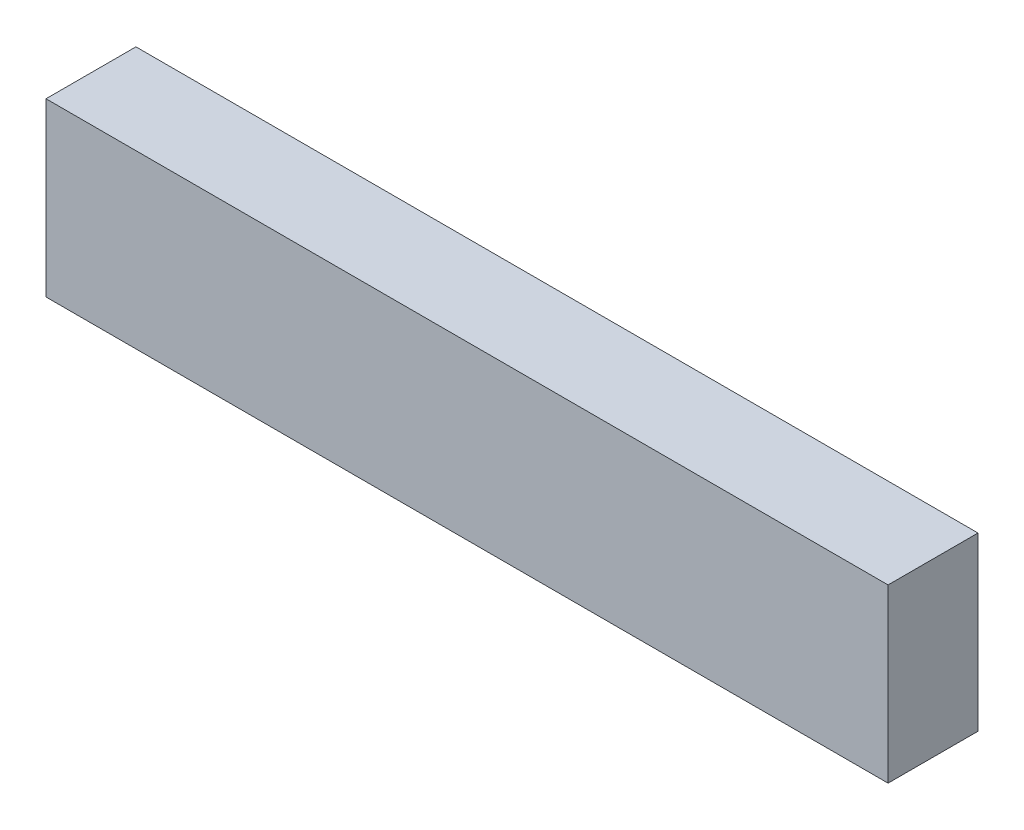
ISO-10303-21;
HEADER;
FILE_DESCRIPTION(('STEP AP214'),'2;1');
FILE_NAME('part.step','',(''),(''),'','','');
FILE_SCHEMA(('AUTOMOTIVE_DESIGN { 1 0 10303 214 1 1 1 1 }'));
ENDSEC;
DATA;
#1=APPLICATION_CONTEXT('core data for automotive mechanical design processes');
#2=APPLICATION_PROTOCOL_DEFINITION('international standard','automotive_design',2000,#1);
#3=PRODUCT_CONTEXT('',#1,'mechanical');
#4=PRODUCT('Part','Part','',(#3));
#5=PRODUCT_RELATED_PRODUCT_CATEGORY('part','',(#4));
#6=PRODUCT_DEFINITION_FORMATION('','',#4);
#7=PRODUCT_DEFINITION_CONTEXT('part definition',#1,'design');
#8=PRODUCT_DEFINITION('design','',#6,#7);
#9=PRODUCT_DEFINITION_SHAPE('','',#8);
#10=(LENGTH_UNIT() NAMED_UNIT(*) SI_UNIT(.MILLI.,.METRE.));
#11=(NAMED_UNIT(*) PLANE_ANGLE_UNIT() SI_UNIT($,.RADIAN.));
#12=(NAMED_UNIT(*) SI_UNIT($,.STERADIAN.) SOLID_ANGLE_UNIT());
#13=UNCERTAINTY_MEASURE_WITH_UNIT(LENGTH_MEASURE(1.E-05),#10,'distance_accuracy_value','');
#14=(GEOMETRIC_REPRESENTATION_CONTEXT(3) GLOBAL_UNCERTAINTY_ASSIGNED_CONTEXT((#13)) GLOBAL_UNIT_ASSIGNED_CONTEXT((#10,
#11,#12)) REPRESENTATION_CONTEXT('',''));
#15=CARTESIAN_POINT('',(0.,0.,0.));
#16=DIRECTION('',(0.,0.,1.));
#17=DIRECTION('',(1.,0.,0.));
#18=AXIS2_PLACEMENT_3D('',#15,#16,#17);
#19=CARTESIAN_POINT('',(0.,66.675,0.));
#20=DIRECTION('',(1.,0.,0.));
#21=DIRECTION('',(0.,0.,-1.));
#22=AXIS2_PLACEMENT_3D('',#19,#20,#21);
#23=PLANE('',#22);
#24=DIRECTION('',(0.,0.,1.));
#25=VECTOR('',#24,1.);
#26=CARTESIAN_POINT('',(0.,0.,0.));
#27=LINE('',#26,#25);
#28=CARTESIAN_POINT('',(0.,0.,-34.925));
#29=VERTEX_POINT('',#28);
#30=CARTESIAN_POINT('',(0.,0.,0.));
#31=VERTEX_POINT('',#30);
#32=EDGE_CURVE('E112',#29,#31,#27,.T.);
#33=ORIENTED_EDGE('',*,*,#32,.T.);
#34=DIRECTION('',(0.,-1.,0.));
#35=VECTOR('',#34,1.);
#36=CARTESIAN_POINT('',(0.,66.675,0.));
#37=LINE('',#36,#35);
#38=CARTESIAN_POINT('',(0.,66.675,0.));
#39=VERTEX_POINT('',#38);
#40=EDGE_CURVE('E11',#39,#31,#37,.T.);
#41=ORIENTED_EDGE('',*,*,#40,.F.);
#42=DIRECTION('',(0.,0.,1.));
#43=VECTOR('',#42,1.);
#44=CARTESIAN_POINT('',(0.,66.675,0.));
#45=LINE('',#44,#43);
#46=CARTESIAN_POINT('',(0.,66.675,-34.925));
#47=VERTEX_POINT('',#46);
#48=EDGE_CURVE('E96',#47,#39,#45,.T.);
#49=ORIENTED_EDGE('',*,*,#48,.F.);
#50=DIRECTION('',(0.,-1.,0.));
#51=VECTOR('',#50,1.);
#52=CARTESIAN_POINT('',(0.,66.675,-34.925));
#53=LINE('',#52,#51);
#54=EDGE_CURVE('E108',#47,#29,#53,.T.);
#55=ORIENTED_EDGE('',*,*,#54,.T.);
#56=EDGE_LOOP('',(#33,#41,#49,#55));
#57=FACE_BOUND('',#56,.T.);
#58=ADVANCED_FACE('F44',(#57),#23,.F.);
#59=CARTESIAN_POINT('',(0.,66.675,0.));
#60=DIRECTION('',(0.,0.,-1.));
#61=DIRECTION('',(-1.,0.,0.));
#62=AXIS2_PLACEMENT_3D('',#59,#60,#61);
#63=PLANE('',#62);
#64=DIRECTION('',(1.,0.,0.));
#65=VECTOR('',#64,1.);
#66=CARTESIAN_POINT('',(0.,0.,0.));
#67=LINE('',#66,#65);
#68=CARTESIAN_POINT('',(327.025,0.,0.));
#69=VERTEX_POINT('',#68);
#70=EDGE_CURVE('E101',#31,#69,#67,.T.);
#71=ORIENTED_EDGE('',*,*,#70,.T.);
#72=DIRECTION('',(0.,-1.,0.));
#73=VECTOR('',#72,1.);
#74=CARTESIAN_POINT('',(327.025,66.675,0.));
#75=LINE('',#74,#73);
#76=CARTESIAN_POINT('',(327.025,66.675,0.));
#77=VERTEX_POINT('',#76);
#78=EDGE_CURVE('E53',#77,#69,#75,.T.);
#79=ORIENTED_EDGE('',*,*,#78,.F.);
#80=DIRECTION('',(1.,0.,0.));
#81=VECTOR('',#80,1.);
#82=CARTESIAN_POINT('',(0.,66.675,0.));
#83=LINE('',#82,#81);
#84=EDGE_CURVE('E91',#39,#77,#83,.T.);
#85=ORIENTED_EDGE('',*,*,#84,.F.);
#86=ORIENTED_EDGE('',*,*,#40,.T.);
#87=EDGE_LOOP('',(#71,#79,#85,#86));
#88=FACE_BOUND('',#87,.T.);
#89=ADVANCED_FACE('F100',(#88),#63,.F.);
#90=CARTESIAN_POINT('',(327.025,66.675,0.));
#91=DIRECTION('',(-1.,0.,0.));
#92=DIRECTION('',(0.,0.,1.));
#93=AXIS2_PLACEMENT_3D('',#90,#91,#92);
#94=PLANE('',#93);
#95=DIRECTION('',(0.,0.,-1.));
#96=VECTOR('',#95,1.);
#97=CARTESIAN_POINT('',(327.025,0.,0.));
#98=LINE('',#97,#96);
#99=CARTESIAN_POINT('',(327.025,0.,-34.925));
#100=VERTEX_POINT('',#99);
#101=EDGE_CURVE('E78',#69,#100,#98,.T.);
#102=ORIENTED_EDGE('',*,*,#101,.T.);
#103=DIRECTION('',(0.,-1.,0.));
#104=VECTOR('',#103,1.);
#105=CARTESIAN_POINT('',(327.025,66.675,-34.925));
#106=LINE('',#105,#104);
#107=CARTESIAN_POINT('',(327.025,66.675,-34.925));
#108=VERTEX_POINT('',#107);
#109=EDGE_CURVE('E103',#108,#100,#106,.T.);
#110=ORIENTED_EDGE('',*,*,#109,.F.);
#111=DIRECTION('',(0.,0.,-1.));
#112=VECTOR('',#111,1.);
#113=CARTESIAN_POINT('',(327.025,66.675,0.));
#114=LINE('',#113,#112);
#115=EDGE_CURVE('E94',#77,#108,#114,.T.);
#116=ORIENTED_EDGE('',*,*,#115,.F.);
#117=ORIENTED_EDGE('',*,*,#78,.T.);
#118=EDGE_LOOP('',(#102,#110,#116,#117));
#119=FACE_BOUND('',#118,.T.);
#120=ADVANCED_FACE('F104',(#119),#94,.F.);
#121=CARTESIAN_POINT('',(0.,66.675,-34.925));
#122=DIRECTION('',(0.,0.,1.));
#123=DIRECTION('',(1.,0.,0.));
#124=AXIS2_PLACEMENT_3D('',#121,#122,#123);
#125=PLANE('',#124);
#126=DIRECTION('',(-1.,0.,0.));
#127=VECTOR('',#126,1.);
#128=CARTESIAN_POINT('',(0.,0.,-34.925));
#129=LINE('',#128,#127);
#130=EDGE_CURVE('E84',#100,#29,#129,.T.);
#131=ORIENTED_EDGE('',*,*,#130,.T.);
#132=ORIENTED_EDGE('',*,*,#54,.F.);
#133=DIRECTION('',(-1.,0.,0.));
#134=VECTOR('',#133,1.);
#135=CARTESIAN_POINT('',(0.,66.675,-34.925));
#136=LINE('',#135,#134);
#137=EDGE_CURVE('E61',#108,#47,#136,.T.);
#138=ORIENTED_EDGE('',*,*,#137,.F.);
#139=ORIENTED_EDGE('',*,*,#109,.T.);
#140=EDGE_LOOP('',(#131,#132,#138,#139));
#141=FACE_BOUND('',#140,.T.);
#142=ADVANCED_FACE('F125',(#141),#125,.F.);
#143=CARTESIAN_POINT('',(0.,66.675,0.));
#144=DIRECTION('',(0.,-1.,0.));
#145=DIRECTION('',(0.,0.,-1.));
#146=AXIS2_PLACEMENT_3D('',#143,#144,#145);
#147=PLANE('',#146);
#148=ORIENTED_EDGE('',*,*,#48,.T.);
#149=ORIENTED_EDGE('',*,*,#84,.T.);
#150=ORIENTED_EDGE('',*,*,#115,.T.);
#151=ORIENTED_EDGE('',*,*,#137,.T.);
#152=EDGE_LOOP('',(#148,#149,#150,#151));
#153=FACE_BOUND('',#152,.T.);
#154=ADVANCED_FACE('F92',(#153),#147,.F.);
#155=CARTESIAN_POINT('',(0.,0.,0.));
#156=DIRECTION('',(0.,-1.,0.));
#157=DIRECTION('',(0.,0.,-1.));
#158=AXIS2_PLACEMENT_3D('',#155,#156,#157);
#159=PLANE('',#158);
#160=ORIENTED_EDGE('',*,*,#32,.F.);
#161=ORIENTED_EDGE('',*,*,#130,.F.);
#162=ORIENTED_EDGE('',*,*,#101,.F.);
#163=ORIENTED_EDGE('',*,*,#70,.F.);
#164=EDGE_LOOP('',(#160,#161,#162,#163));
#165=FACE_BOUND('',#164,.T.);
#166=ADVANCED_FACE('F128',(#165),#159,.T.);
#167=CLOSED_SHELL('',(#58,#89,#120,#142,#154,#166));
#168=MANIFOLD_SOLID_BREP('B2',#167);
#169=ADVANCED_BREP_SHAPE_REPRESENTATION('',(#18,#168),#14);
#170=SHAPE_DEFINITION_REPRESENTATION(#9,#169);
ENDSEC;
END-ISO-10303-21;
